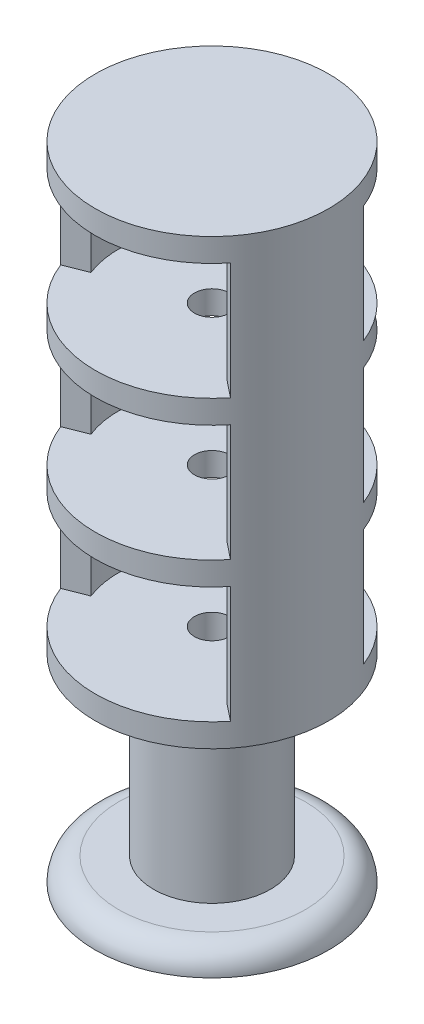
ISO-10303-21;
HEADER;
FILE_DESCRIPTION(('STEP AP214'),'2;1');
FILE_NAME('part.step','',(''),(''),'','','');
FILE_SCHEMA(('AUTOMOTIVE_DESIGN { 1 0 10303 214 1 1 1 1 }'));
ENDSEC;
DATA;
#1=APPLICATION_CONTEXT('core data for automotive mechanical design processes');
#2=APPLICATION_PROTOCOL_DEFINITION('international standard','automotive_design',2000,#1);
#3=PRODUCT_CONTEXT('',#1,'mechanical');
#4=PRODUCT('Part','Part','',(#3));
#5=PRODUCT_RELATED_PRODUCT_CATEGORY('part','',(#4));
#6=PRODUCT_DEFINITION_FORMATION('','',#4);
#7=PRODUCT_DEFINITION_CONTEXT('part definition',#1,'design');
#8=PRODUCT_DEFINITION('design','',#6,#7);
#9=PRODUCT_DEFINITION_SHAPE('','',#8);
#10=(LENGTH_UNIT() NAMED_UNIT(*) SI_UNIT(.MILLI.,.METRE.));
#11=(NAMED_UNIT(*) PLANE_ANGLE_UNIT() SI_UNIT($,.RADIAN.));
#12=(NAMED_UNIT(*) SI_UNIT($,.STERADIAN.) SOLID_ANGLE_UNIT());
#13=UNCERTAINTY_MEASURE_WITH_UNIT(LENGTH_MEASURE(1.E-05),#10,'distance_accuracy_value','');
#14=(GEOMETRIC_REPRESENTATION_CONTEXT(3) GLOBAL_UNCERTAINTY_ASSIGNED_CONTEXT((#13)) GLOBAL_UNIT_ASSIGNED_CONTEXT((#10,
#11,#12)) REPRESENTATION_CONTEXT('',''));
#15=CARTESIAN_POINT('',(0.,0.,0.));
#16=DIRECTION('',(0.,0.,1.));
#17=DIRECTION('',(1.,0.,0.));
#18=AXIS2_PLACEMENT_3D('',#15,#16,#17);
#19=CARTESIAN_POINT('',(0.,0.,0.));
#20=DIRECTION('',(0.,1.,0.));
#21=DIRECTION('',(0.,0.,1.));
#22=AXIS2_PLACEMENT_3D('',#19,#20,#21);
#23=PLANE('',#22);
#24=CARTESIAN_POINT('',(0.,0.,0.));
#25=DIRECTION('',(0.,1.,0.));
#26=DIRECTION('',(0.,0.,1.));
#27=AXIS2_PLACEMENT_3D('',#24,#25,#26);
#28=CIRCLE('',#27,8.);
#29=CARTESIAN_POINT('',(0.,0.,8.));
#30=VERTEX_POINT('',#29);
#31=EDGE_CURVE('E13',#30,#30,#28,.T.);
#32=ORIENTED_EDGE('',*,*,#31,.T.);
#33=EDGE_LOOP('',(#32));
#34=FACE_BOUND('',#33,.T.);
#35=CARTESIAN_POINT('',(0.,0.,0.));
#36=DIRECTION('',(0.,1.,0.));
#37=DIRECTION('',(0.,0.,1.));
#38=AXIS2_PLACEMENT_3D('',#35,#36,#37);
#39=CIRCLE('',#38,5.);
#40=CARTESIAN_POINT('',(0.,0.,5.));
#41=VERTEX_POINT('',#40);
#42=EDGE_CURVE('E482',#41,#41,#39,.T.);
#43=ORIENTED_EDGE('',*,*,#42,.F.);
#44=EDGE_LOOP('',(#43));
#45=FACE_BOUND('',#44,.T.);
#46=ADVANCED_FACE('F50',(#34,#45),#23,.T.);
#47=CARTESIAN_POINT('',(0.,-2.,0.));
#48=DIRECTION('',(0.,1.,0.));
#49=DIRECTION('',(0.,0.,1.));
#50=AXIS2_PLACEMENT_3D('',#47,#48,#49);
#51=PLANE('',#50);
#52=CARTESIAN_POINT('',(0.,-2.,0.));
#53=DIRECTION('',(0.,-1.,0.));
#54=DIRECTION('',(0.,0.,-1.));
#55=AXIS2_PLACEMENT_3D('',#52,#53,#54);
#56=CIRCLE('',#55,2.5);
#57=CARTESIAN_POINT('',(0.,-2.,-2.5));
#58=VERTEX_POINT('',#57);
#59=EDGE_CURVE('E509',#58,#58,#56,.T.);
#60=ORIENTED_EDGE('',*,*,#59,.F.);
#61=EDGE_LOOP('',(#60));
#62=FACE_BOUND('',#61,.T.);
#63=CARTESIAN_POINT('',(0.,-2.,0.));
#64=DIRECTION('',(0.,1.,0.));
#65=DIRECTION('',(0.,0.,1.));
#66=AXIS2_PLACEMENT_3D('',#63,#64,#65);
#67=CIRCLE('',#66,10.);
#68=CARTESIAN_POINT('',(0.,-2.,10.));
#69=VERTEX_POINT('',#68);
#70=EDGE_CURVE('E59',#69,#69,#67,.T.);
#71=ORIENTED_EDGE('',*,*,#70,.F.);
#72=EDGE_LOOP('',(#71));
#73=FACE_BOUND('',#72,.T.);
#74=ADVANCED_FACE('F608',(#62,#73),#51,.F.);
#75=CARTESIAN_POINT('',(0.,-16.142135623731,0.));
#76=DIRECTION('',(0.,1.,0.));
#77=DIRECTION('',(0.,0.,1.));
#78=AXIS2_PLACEMENT_3D('',#75,#76,#77);
#79=CYLINDRICAL_SURFACE('',#78,1.5);
#80=CARTESIAN_POINT('',(0.,13.,0.));
#81=DIRECTION('',(0.,1.,0.));
#82=DIRECTION('',(0.,0.,1.));
#83=AXIS2_PLACEMENT_3D('',#80,#81,#82);
#84=CIRCLE('',#83,1.5);
#85=CARTESIAN_POINT('',(0.,13.,1.5));
#86=VERTEX_POINT('',#85);
#87=EDGE_CURVE('E496',#86,#86,#84,.F.);
#88=ORIENTED_EDGE('',*,*,#87,.T.);
#89=EDGE_LOOP('',(#88));
#90=FACE_BOUND('',#89,.T.);
#91=CARTESIAN_POINT('',(0.,17.,0.));
#92=DIRECTION('',(0.,1.,0.));
#93=DIRECTION('',(0.,0.,1.));
#94=AXIS2_PLACEMENT_3D('',#91,#92,#93);
#95=CIRCLE('',#94,1.5);
#96=CARTESIAN_POINT('',(0.,17.,1.5));
#97=VERTEX_POINT('',#96);
#98=EDGE_CURVE('E251',#97,#97,#95,.T.);
#99=ORIENTED_EDGE('',*,*,#98,.T.);
#100=EDGE_LOOP('',(#99));
#101=FACE_BOUND('',#100,.T.);
#102=ADVANCED_FACE('F531',(#90,#101),#79,.F.);
#103=CARTESIAN_POINT('',(0.,17.,0.));
#104=DIRECTION('',(0.,1.,0.));
#105=DIRECTION('',(0.,0.,1.));
#106=AXIS2_PLACEMENT_3D('',#103,#104,#105);
#107=PLANE('',#106);
#108=ORIENTED_EDGE('',*,*,#98,.F.);
#109=EDGE_LOOP('',(#108));
#110=FACE_BOUND('',#109,.T.);
#111=CARTESIAN_POINT('',(0.,17.,0.));
#112=DIRECTION('',(0.,1.,0.));
#113=DIRECTION('',(0.,0.,1.));
#114=AXIS2_PLACEMENT_3D('',#111,#112,#113);
#115=CIRCLE('',#114,10.);
#116=CARTESIAN_POINT('',(-9.30914679157328,17.,3.65236717937024));
#117=VERTEX_POINT('',#116);
#118=CARTESIAN_POINT('',(7.81761615706981,17.,6.2357740193757));
#119=VERTEX_POINT('',#118);
#120=EDGE_CURVE('E479',#117,#119,#115,.T.);
#121=ORIENTED_EDGE('',*,*,#120,.T.);
#122=DIRECTION('',(0.781761615706981,0.,0.62357740193757));
#123=VECTOR('',#122,1.);
#124=CARTESIAN_POINT('',(0.,17.,0.));
#125=LINE('',#124,#123);
#126=CARTESIAN_POINT('',(6.25409292565585,17.,4.98861921550056));
#127=VERTEX_POINT('',#126);
#128=EDGE_CURVE('E419',#127,#119,#125,.T.);
#129=ORIENTED_EDGE('',*,*,#128,.F.);
#130=CARTESIAN_POINT('',(0.,17.,0.));
#131=DIRECTION('',(0.,1.,0.));
#132=DIRECTION('',(0.,0.,1.));
#133=AXIS2_PLACEMENT_3D('',#130,#131,#132);
#134=CIRCLE('',#133,8.);
#135=CARTESIAN_POINT('',(7.44731743325862,17.,-2.92189374349619));
#136=VERTEX_POINT('',#135);
#137=EDGE_CURVE('E397',#127,#136,#134,.T.);
#138=ORIENTED_EDGE('',*,*,#137,.T.);
#139=DIRECTION('',(-0.930914679157328,0.,0.365236717937024));
#140=VECTOR('',#139,1.);
#141=CARTESIAN_POINT('',(0.,17.,0.));
#142=LINE('',#141,#140);
#143=CARTESIAN_POINT('',(9.30914679157328,17.,-3.65236717937024));
#144=VERTEX_POINT('',#143);
#145=EDGE_CURVE('E408',#144,#136,#142,.T.);
#146=ORIENTED_EDGE('',*,*,#145,.F.);
#147=CARTESIAN_POINT('',(-7.81761615706982,17.,-6.2357740193757));
#148=VERTEX_POINT('',#147);
#149=EDGE_CURVE('E483',#144,#148,#115,.T.);
#150=ORIENTED_EDGE('',*,*,#149,.T.);
#151=DIRECTION('',(0.781761615706981,0.,0.62357740193757));
#152=VECTOR('',#151,1.);
#153=CARTESIAN_POINT('',(0.,17.,0.));
#154=LINE('',#153,#152);
#155=CARTESIAN_POINT('',(-6.25409292565585,17.,-4.98861921550056));
#156=VERTEX_POINT('',#155);
#157=EDGE_CURVE('E458',#148,#156,#154,.T.);
#158=ORIENTED_EDGE('',*,*,#157,.T.);
#159=CARTESIAN_POINT('',(0.,17.,0.));
#160=DIRECTION('',(0.,1.,0.));
#161=DIRECTION('',(0.,0.,1.));
#162=AXIS2_PLACEMENT_3D('',#159,#160,#161);
#163=CIRCLE('',#162,8.);
#164=CARTESIAN_POINT('',(-7.44731743325862,17.,2.92189374349619));
#165=VERTEX_POINT('',#164);
#166=EDGE_CURVE('E441',#156,#165,#163,.T.);
#167=ORIENTED_EDGE('',*,*,#166,.T.);
#168=DIRECTION('',(-0.930914679157328,0.,0.365236717937024));
#169=VECTOR('',#168,1.);
#170=CARTESIAN_POINT('',(0.,17.,0.));
#171=LINE('',#170,#169);
#172=EDGE_CURVE('E447',#165,#117,#171,.T.);
#173=ORIENTED_EDGE('',*,*,#172,.T.);
#174=EDGE_LOOP('',(#121,#129,#138,#146,#150,#158,#167,#173));
#175=FACE_BOUND('',#174,.T.);
#176=ADVANCED_FACE('F533',(#110,#175),#107,.T.);
#177=CARTESIAN_POINT('',(0.,15.,0.));
#178=DIRECTION('',(0.,-1.,0.));
#179=DIRECTION('',(0.,0.,-1.));
#180=AXIS2_PLACEMENT_3D('',#177,#178,#179);
#181=CYLINDRICAL_SURFACE('',#180,5.);
#182=CARTESIAN_POINT('',(0.,15.,0.));
#183=DIRECTION('',(0.,1.,0.));
#184=DIRECTION('',(0.,0.,1.));
#185=AXIS2_PLACEMENT_3D('',#182,#183,#184);
#186=CIRCLE('',#185,5.);
#187=CARTESIAN_POINT('',(0.,15.,5.));
#188=VERTEX_POINT('',#187);
#189=EDGE_CURVE('E487',#188,#188,#186,.T.);
#190=ORIENTED_EDGE('',*,*,#189,.F.);
#191=EDGE_LOOP('',(#190));
#192=FACE_BOUND('',#191,.T.);
#193=ORIENTED_EDGE('',*,*,#42,.T.);
#194=EDGE_LOOP('',(#193));
#195=FACE_BOUND('',#194,.T.);
#196=ADVANCED_FACE('F536',(#192,#195),#181,.T.);
#197=CARTESIAN_POINT('',(0.,17.,0.));
#198=DIRECTION('',(0.,-1.,0.));
#199=DIRECTION('',(0.,0.,-1.));
#200=AXIS2_PLACEMENT_3D('',#197,#198,#199);
#201=CYLINDRICAL_SURFACE('',#200,10.);
#202=DIRECTION('',(0.,-1.,0.));
#203=VECTOR('',#202,1.);
#204=CARTESIAN_POINT('',(-9.30914679157328,51.,3.65236717937024));
#205=LINE('',#204,#203);
#206=CARTESIAN_POINT('',(-9.30914679157328,51.,3.65236717937024));
#207=VERTEX_POINT('',#206);
#208=CARTESIAN_POINT('',(-9.30914679157328,41.,3.65236717937024));
#209=VERTEX_POINT('',#208);
#210=EDGE_CURVE('E303',#207,#209,#205,.T.);
#211=ORIENTED_EDGE('',*,*,#210,.F.);
#212=CARTESIAN_POINT('',(0.,51.,0.));
#213=DIRECTION('',(0.,1.,0.));
#214=DIRECTION('',(0.,0.,1.));
#215=AXIS2_PLACEMENT_3D('',#212,#213,#214);
#216=CIRCLE('',#215,10.);
#217=CARTESIAN_POINT('',(7.81761615706982,51.,6.2357740193757));
#218=VERTEX_POINT('',#217);
#219=EDGE_CURVE('E243',#207,#218,#216,.T.);
#220=ORIENTED_EDGE('',*,*,#219,.T.);
#221=DIRECTION('',(0.,-1.,0.));
#222=VECTOR('',#221,1.);
#223=CARTESIAN_POINT('',(7.81761615706982,51.,6.2357740193757));
#224=LINE('',#223,#222);
#225=CARTESIAN_POINT('',(7.81761615706981,41.,6.2357740193757));
#226=VERTEX_POINT('',#225);
#227=EDGE_CURVE('E233',#218,#226,#224,.T.);
#228=ORIENTED_EDGE('',*,*,#227,.T.);
#229=CARTESIAN_POINT('',(0.,41.,0.));
#230=DIRECTION('',(0.,1.,0.));
#231=DIRECTION('',(0.,0.,1.));
#232=AXIS2_PLACEMENT_3D('',#229,#230,#231);
#233=CIRCLE('',#232,10.);
#234=EDGE_CURVE('E310',#209,#226,#233,.T.);
#235=ORIENTED_EDGE('',*,*,#234,.F.);
#236=EDGE_LOOP('',(#211,#220,#228,#235));
#237=FACE_BOUND('',#236,.T.);
#238=DIRECTION('',(0.,-1.,0.));
#239=VECTOR('',#238,1.);
#240=CARTESIAN_POINT('',(-9.30914679157328,39.,3.65236717937024));
#241=LINE('',#240,#239);
#242=CARTESIAN_POINT('',(-9.30914679157328,39.,3.65236717937024));
#243=VERTEX_POINT('',#242);
#244=CARTESIAN_POINT('',(-9.30914679157328,29.,3.65236717937024));
#245=VERTEX_POINT('',#244);
#246=EDGE_CURVE('E387',#243,#245,#241,.T.);
#247=ORIENTED_EDGE('',*,*,#246,.F.);
#248=CARTESIAN_POINT('',(0.,39.,0.));
#249=DIRECTION('',(0.,1.,0.));
#250=DIRECTION('',(0.,0.,1.));
#251=AXIS2_PLACEMENT_3D('',#248,#249,#250);
#252=CIRCLE('',#251,10.);
#253=CARTESIAN_POINT('',(7.81761615706982,39.,6.23577401937571));
#254=VERTEX_POINT('',#253);
#255=EDGE_CURVE('E299',#243,#254,#252,.T.);
#256=ORIENTED_EDGE('',*,*,#255,.T.);
#257=DIRECTION('',(0.,-1.,0.));
#258=VECTOR('',#257,1.);
#259=CARTESIAN_POINT('',(7.81761615706982,39.,6.23577401937571));
#260=LINE('',#259,#258);
#261=CARTESIAN_POINT('',(7.81761615706981,29.,6.2357740193757));
#262=VERTEX_POINT('',#261);
#263=EDGE_CURVE('E348',#254,#262,#260,.T.);
#264=ORIENTED_EDGE('',*,*,#263,.T.);
#265=CARTESIAN_POINT('',(0.,29.,0.));
#266=DIRECTION('',(0.,1.,0.));
#267=DIRECTION('',(0.,0.,1.));
#268=AXIS2_PLACEMENT_3D('',#265,#266,#267);
#269=CIRCLE('',#268,10.);
#270=EDGE_CURVE('E394',#245,#262,#269,.T.);
#271=ORIENTED_EDGE('',*,*,#270,.F.);
#272=EDGE_LOOP('',(#247,#256,#264,#271));
#273=FACE_BOUND('',#272,.T.);
#274=DIRECTION('',(0.,-1.,0.));
#275=VECTOR('',#274,1.);
#276=CARTESIAN_POINT('',(-9.30914679157328,27.,3.65236717937024));
#277=LINE('',#276,#275);
#278=CARTESIAN_POINT('',(-9.30914679157328,27.,3.65236717937024));
#279=VERTEX_POINT('',#278);
#280=EDGE_CURVE('E467',#279,#117,#277,.T.);
#281=ORIENTED_EDGE('',*,*,#280,.F.);
#282=CARTESIAN_POINT('',(0.,27.,0.));
#283=DIRECTION('',(0.,1.,0.));
#284=DIRECTION('',(0.,0.,1.));
#285=AXIS2_PLACEMENT_3D('',#282,#283,#284);
#286=CIRCLE('',#285,10.);
#287=CARTESIAN_POINT('',(7.81761615706982,27.,6.2357740193757));
#288=VERTEX_POINT('',#287);
#289=EDGE_CURVE('E382',#279,#288,#286,.T.);
#290=ORIENTED_EDGE('',*,*,#289,.T.);
#291=DIRECTION('',(0.,-1.,0.));
#292=VECTOR('',#291,1.);
#293=CARTESIAN_POINT('',(7.81761615706982,27.,6.2357740193757));
#294=LINE('',#293,#292);
#295=EDGE_CURVE('E433',#288,#119,#294,.T.);
#296=ORIENTED_EDGE('',*,*,#295,.T.);
#297=ORIENTED_EDGE('',*,*,#120,.F.);
#298=EDGE_LOOP('',(#281,#290,#296,#297));
#299=FACE_BOUND('',#298,.T.);
#300=CARTESIAN_POINT('',(9.30914679157328,27.,-3.65236717937024));
#301=VERTEX_POINT('',#300);
#302=CARTESIAN_POINT('',(-7.81761615706982,27.,-6.2357740193757));
#303=VERTEX_POINT('',#302);
#304=EDGE_CURVE('E402',#301,#303,#286,.T.);
#305=ORIENTED_EDGE('',*,*,#304,.T.);
#306=DIRECTION('',(0.,-1.,0.));
#307=VECTOR('',#306,1.);
#308=CARTESIAN_POINT('',(-7.81761615706982,27.,-6.2357740193757));
#309=LINE('',#308,#307);
#310=EDGE_CURVE('E470',#303,#148,#309,.T.);
#311=ORIENTED_EDGE('',*,*,#310,.T.);
#312=ORIENTED_EDGE('',*,*,#149,.F.);
#313=DIRECTION('',(0.,-1.,0.));
#314=VECTOR('',#313,1.);
#315=CARTESIAN_POINT('',(9.30914679157328,27.,-3.65236717937024));
#316=LINE('',#315,#314);
#317=EDGE_CURVE('E429',#301,#144,#316,.T.);
#318=ORIENTED_EDGE('',*,*,#317,.F.);
#319=EDGE_LOOP('',(#305,#311,#312,#318));
#320=FACE_BOUND('',#319,.T.);
#321=CARTESIAN_POINT('',(0.,15.,0.));
#322=DIRECTION('',(0.,1.,0.));
#323=DIRECTION('',(0.,0.,1.));
#324=AXIS2_PLACEMENT_3D('',#321,#322,#323);
#325=CIRCLE('',#324,10.);
#326=CARTESIAN_POINT('',(0.,15.,10.));
#327=VERTEX_POINT('',#326);
#328=EDGE_CURVE('E478',#327,#327,#325,.T.);
#329=ORIENTED_EDGE('',*,*,#328,.T.);
#330=EDGE_LOOP('',(#329));
#331=FACE_BOUND('',#330,.T.);
#332=CARTESIAN_POINT('',(9.30914679157328,39.,-3.65236717937024));
#333=VERTEX_POINT('',#332);
#334=CARTESIAN_POINT('',(-7.81761615706981,39.,-6.23577401937571));
#335=VERTEX_POINT('',#334);
#336=EDGE_CURVE('E317',#333,#335,#252,.T.);
#337=ORIENTED_EDGE('',*,*,#336,.T.);
#338=DIRECTION('',(0.,-1.,0.));
#339=VECTOR('',#338,1.);
#340=CARTESIAN_POINT('',(-7.81761615706981,39.,-6.23577401937571));
#341=LINE('',#340,#339);
#342=CARTESIAN_POINT('',(-7.81761615706981,29.,-6.23577401937571));
#343=VERTEX_POINT('',#342);
#344=EDGE_CURVE('E383',#335,#343,#341,.T.);
#345=ORIENTED_EDGE('',*,*,#344,.T.);
#346=CARTESIAN_POINT('',(9.30914679157328,29.,-3.65236717937024));
#347=VERTEX_POINT('',#346);
#348=EDGE_CURVE('E398',#347,#343,#269,.T.);
#349=ORIENTED_EDGE('',*,*,#348,.F.);
#350=DIRECTION('',(0.,-1.,0.));
#351=VECTOR('',#350,1.);
#352=CARTESIAN_POINT('',(9.30914679157328,39.,-3.65236717937024));
#353=LINE('',#352,#351);
#354=EDGE_CURVE('E330',#333,#347,#353,.T.);
#355=ORIENTED_EDGE('',*,*,#354,.F.);
#356=EDGE_LOOP('',(#337,#345,#349,#355));
#357=FACE_BOUND('',#356,.T.);
#358=CARTESIAN_POINT('',(9.30914679157328,51.,-3.65236717937024));
#359=VERTEX_POINT('',#358);
#360=CARTESIAN_POINT('',(-7.81761615706981,51.,-6.23577401937571));
#361=VERTEX_POINT('',#360);
#362=EDGE_CURVE('E230',#359,#361,#216,.T.);
#363=ORIENTED_EDGE('',*,*,#362,.T.);
#364=DIRECTION('',(0.,-1.,0.));
#365=VECTOR('',#364,1.);
#366=CARTESIAN_POINT('',(-7.81761615706981,51.,-6.23577401937571));
#367=LINE('',#366,#365);
#368=CARTESIAN_POINT('',(-7.81761615706981,41.,-6.23577401937571));
#369=VERTEX_POINT('',#368);
#370=EDGE_CURVE('E300',#361,#369,#367,.T.);
#371=ORIENTED_EDGE('',*,*,#370,.T.);
#372=CARTESIAN_POINT('',(9.30914679157328,41.,-3.65236717937024));
#373=VERTEX_POINT('',#372);
#374=EDGE_CURVE('E231',#373,#369,#233,.T.);
#375=ORIENTED_EDGE('',*,*,#374,.F.);
#376=DIRECTION('',(0.,-1.,0.));
#377=VECTOR('',#376,1.);
#378=CARTESIAN_POINT('',(9.30914679157328,51.,-3.65236717937024));
#379=LINE('',#378,#377);
#380=EDGE_CURVE('E216',#359,#373,#379,.T.);
#381=ORIENTED_EDGE('',*,*,#380,.F.);
#382=EDGE_LOOP('',(#363,#371,#375,#381));
#383=FACE_BOUND('',#382,.T.);
#384=CARTESIAN_POINT('',(0.,53.,0.));
#385=DIRECTION('',(0.,1.,0.));
#386=DIRECTION('',(0.,0.,1.));
#387=AXIS2_PLACEMENT_3D('',#384,#385,#386);
#388=CIRCLE('',#387,10.);
#389=CARTESIAN_POINT('',(0.,53.,10.));
#390=VERTEX_POINT('',#389);
#391=EDGE_CURVE('E242',#390,#390,#388,.T.);
#392=ORIENTED_EDGE('',*,*,#391,.F.);
#393=EDGE_LOOP('',(#392));
#394=FACE_BOUND('',#393,.T.);
#395=ADVANCED_FACE('F227',(#237,#273,#299,#320,#331,#357,#383,#394),#201,.T.);
#396=CARTESIAN_POINT('',(0.,15.,0.));
#397=DIRECTION('',(0.,1.,0.));
#398=DIRECTION('',(0.,0.,1.));
#399=AXIS2_PLACEMENT_3D('',#396,#397,#398);
#400=PLANE('',#399);
#401=ORIENTED_EDGE('',*,*,#189,.T.);
#402=EDGE_LOOP('',(#401));
#403=FACE_BOUND('',#402,.T.);
#404=ORIENTED_EDGE('',*,*,#328,.F.);
#405=EDGE_LOOP('',(#404));
#406=FACE_BOUND('',#405,.T.);
#407=ADVANCED_FACE('F624',(#403,#406),#400,.F.);
#408=CARTESIAN_POINT('',(0.,27.,0.));
#409=DIRECTION('',(0.,-1.,0.));
#410=DIRECTION('',(0.,0.,-1.));
#411=AXIS2_PLACEMENT_3D('',#408,#409,#410);
#412=CYLINDRICAL_SURFACE('',#411,8.);
#413=ORIENTED_EDGE('',*,*,#166,.F.);
#414=DIRECTION('',(0.,-1.,0.));
#415=VECTOR('',#414,1.);
#416=CARTESIAN_POINT('',(-6.25409292565585,27.,-4.98861921550056));
#417=LINE('',#416,#415);
#418=CARTESIAN_POINT('',(-6.25409292565585,27.,-4.98861921550056));
#419=VERTEX_POINT('',#418);
#420=EDGE_CURVE('E474',#419,#156,#417,.T.);
#421=ORIENTED_EDGE('',*,*,#420,.F.);
#422=CARTESIAN_POINT('',(0.,27.,0.));
#423=DIRECTION('',(0.,1.,0.));
#424=DIRECTION('',(0.,0.,1.));
#425=AXIS2_PLACEMENT_3D('',#422,#423,#424);
#426=CIRCLE('',#425,8.);
#427=CARTESIAN_POINT('',(-7.44731743325862,27.,2.92189374349619));
#428=VERTEX_POINT('',#427);
#429=EDGE_CURVE('E442',#419,#428,#426,.T.);
#430=ORIENTED_EDGE('',*,*,#429,.T.);
#431=DIRECTION('',(0.,-1.,0.));
#432=VECTOR('',#431,1.);
#433=CARTESIAN_POINT('',(-7.44731743325862,27.,2.92189374349619));
#434=LINE('',#433,#432);
#435=EDGE_CURVE('E454',#428,#165,#434,.T.);
#436=ORIENTED_EDGE('',*,*,#435,.T.);
#437=EDGE_LOOP('',(#413,#421,#430,#436));
#438=FACE_BOUND('',#437,.T.);
#439=ADVANCED_FACE('F626',(#438),#412,.F.);
#440=CARTESIAN_POINT('',(0.,27.,0.));
#441=DIRECTION('',(0.62357740193757,0.,-0.781761615706981));
#442=DIRECTION('',(-0.781761615706981,0.,-0.62357740193757));
#443=AXIS2_PLACEMENT_3D('',#440,#441,#442);
#444=PLANE('',#443);
#445=ORIENTED_EDGE('',*,*,#157,.F.);
#446=ORIENTED_EDGE('',*,*,#310,.F.);
#447=DIRECTION('',(0.781761615706981,0.,0.62357740193757));
#448=VECTOR('',#447,1.);
#449=CARTESIAN_POINT('',(0.,27.,0.));
#450=LINE('',#449,#448);
#451=EDGE_CURVE('E446',#303,#419,#450,.T.);
#452=ORIENTED_EDGE('',*,*,#451,.T.);
#453=ORIENTED_EDGE('',*,*,#420,.T.);
#454=EDGE_LOOP('',(#445,#446,#452,#453));
#455=FACE_BOUND('',#454,.T.);
#456=ADVANCED_FACE('F631',(#455),#444,.T.);
#457=CARTESIAN_POINT('',(0.,27.,0.));
#458=DIRECTION('',(0.365236717937024,0.,0.930914679157328));
#459=DIRECTION('',(0.930914679157328,0.,-0.365236717937024));
#460=AXIS2_PLACEMENT_3D('',#457,#458,#459);
#461=PLANE('',#460);
#462=ORIENTED_EDGE('',*,*,#172,.F.);
#463=ORIENTED_EDGE('',*,*,#435,.F.);
#464=DIRECTION('',(-0.930914679157328,0.,0.365236717937024));
#465=VECTOR('',#464,1.);
#466=CARTESIAN_POINT('',(0.,27.,0.));
#467=LINE('',#466,#465);
#468=EDGE_CURVE('E451',#428,#279,#467,.T.);
#469=ORIENTED_EDGE('',*,*,#468,.T.);
#470=ORIENTED_EDGE('',*,*,#280,.T.);
#471=EDGE_LOOP('',(#462,#463,#469,#470));
#472=FACE_BOUND('',#471,.T.);
#473=ADVANCED_FACE('F635',(#472),#461,.T.);
#474=CARTESIAN_POINT('',(0.,27.,0.));
#475=DIRECTION('',(0.,-1.,0.));
#476=DIRECTION('',(0.,0.,-1.));
#477=AXIS2_PLACEMENT_3D('',#474,#475,#476);
#478=CYLINDRICAL_SURFACE('',#477,8.);
#479=ORIENTED_EDGE('',*,*,#137,.F.);
#480=DIRECTION('',(0.,-1.,0.));
#481=VECTOR('',#480,1.);
#482=CARTESIAN_POINT('',(6.25409292565585,27.,4.98861921550056));
#483=LINE('',#482,#481);
#484=CARTESIAN_POINT('',(6.25409292565585,27.,4.98861921550056));
#485=VERTEX_POINT('',#484);
#486=EDGE_CURVE('E437',#485,#127,#483,.T.);
#487=ORIENTED_EDGE('',*,*,#486,.F.);
#488=CARTESIAN_POINT('',(0.,27.,0.));
#489=DIRECTION('',(0.,1.,0.));
#490=DIRECTION('',(0.,0.,1.));
#491=AXIS2_PLACEMENT_3D('',#488,#489,#490);
#492=CIRCLE('',#491,8.);
#493=CARTESIAN_POINT('',(7.44731743325862,27.,-2.92189374349619));
#494=VERTEX_POINT('',#493);
#495=EDGE_CURVE('E403',#485,#494,#492,.T.);
#496=ORIENTED_EDGE('',*,*,#495,.T.);
#497=DIRECTION('',(0.,-1.,0.));
#498=VECTOR('',#497,1.);
#499=CARTESIAN_POINT('',(7.44731743325862,27.,-2.92189374349619));
#500=LINE('',#499,#498);
#501=EDGE_CURVE('E416',#494,#136,#500,.T.);
#502=ORIENTED_EDGE('',*,*,#501,.T.);
#503=EDGE_LOOP('',(#479,#487,#496,#502));
#504=FACE_BOUND('',#503,.T.);
#505=ADVANCED_FACE('F556',(#504),#478,.F.);
#506=CARTESIAN_POINT('',(0.,27.,0.));
#507=DIRECTION('',(0.62357740193757,0.,-0.781761615706981));
#508=DIRECTION('',(-0.781761615706981,0.,-0.62357740193757));
#509=AXIS2_PLACEMENT_3D('',#506,#507,#508);
#510=PLANE('',#509);
#511=ORIENTED_EDGE('',*,*,#128,.T.);
#512=ORIENTED_EDGE('',*,*,#295,.F.);
#513=DIRECTION('',(0.781761615706981,0.,0.62357740193757));
#514=VECTOR('',#513,1.);
#515=CARTESIAN_POINT('',(0.,27.,0.));
#516=LINE('',#515,#514);
#517=EDGE_CURVE('E407',#485,#288,#516,.T.);
#518=ORIENTED_EDGE('',*,*,#517,.F.);
#519=ORIENTED_EDGE('',*,*,#486,.T.);
#520=EDGE_LOOP('',(#511,#512,#518,#519));
#521=FACE_BOUND('',#520,.T.);
#522=ADVANCED_FACE('F543',(#521),#510,.F.);
#523=CARTESIAN_POINT('',(0.,27.,0.));
#524=DIRECTION('',(0.365236717937024,0.,0.930914679157328));
#525=DIRECTION('',(0.930914679157328,0.,-0.365236717937024));
#526=AXIS2_PLACEMENT_3D('',#523,#524,#525);
#527=PLANE('',#526);
#528=ORIENTED_EDGE('',*,*,#145,.T.);
#529=ORIENTED_EDGE('',*,*,#501,.F.);
#530=DIRECTION('',(-0.930914679157328,0.,0.365236717937024));
#531=VECTOR('',#530,1.);
#532=CARTESIAN_POINT('',(0.,27.,0.));
#533=LINE('',#532,#531);
#534=EDGE_CURVE('E412',#301,#494,#533,.T.);
#535=ORIENTED_EDGE('',*,*,#534,.F.);
#536=ORIENTED_EDGE('',*,*,#317,.T.);
#537=EDGE_LOOP('',(#528,#529,#535,#536));
#538=FACE_BOUND('',#537,.T.);
#539=ADVANCED_FACE('F560',(#538),#527,.F.);
#540=CARTESIAN_POINT('',(0.,27.,0.));
#541=DIRECTION('',(0.,1.,0.));
#542=DIRECTION('',(0.,0.,1.));
#543=AXIS2_PLACEMENT_3D('',#540,#541,#542);
#544=PLANE('',#543);
#545=CARTESIAN_POINT('',(0.,27.,0.));
#546=DIRECTION('',(0.,1.,0.));
#547=DIRECTION('',(0.,0.,1.));
#548=AXIS2_PLACEMENT_3D('',#545,#546,#547);
#549=CIRCLE('',#548,1.5);
#550=CARTESIAN_POINT('',(0.,27.,1.5));
#551=VERTEX_POINT('',#550);
#552=EDGE_CURVE('E524',#551,#551,#549,.T.);
#553=ORIENTED_EDGE('',*,*,#552,.T.);
#554=EDGE_LOOP('',(#553));
#555=FACE_BOUND('',#554,.T.);
#556=ORIENTED_EDGE('',*,*,#451,.F.);
#557=ORIENTED_EDGE('',*,*,#304,.F.);
#558=ORIENTED_EDGE('',*,*,#534,.T.);
#559=ORIENTED_EDGE('',*,*,#495,.F.);
#560=ORIENTED_EDGE('',*,*,#517,.T.);
#561=ORIENTED_EDGE('',*,*,#289,.F.);
#562=ORIENTED_EDGE('',*,*,#468,.F.);
#563=ORIENTED_EDGE('',*,*,#429,.F.);
#564=EDGE_LOOP('',(#556,#557,#558,#559,#560,#561,#562,#563));
#565=FACE_BOUND('',#564,.T.);
#566=ADVANCED_FACE('F551',(#555,#565),#544,.F.);
#567=CARTESIAN_POINT('',(0.,29.,0.));
#568=DIRECTION('',(0.,1.,0.));
#569=DIRECTION('',(0.,0.,1.));
#570=AXIS2_PLACEMENT_3D('',#567,#568,#569);
#571=PLANE('',#570);
#572=CARTESIAN_POINT('',(0.,29.,0.));
#573=DIRECTION('',(0.,1.,0.));
#574=DIRECTION('',(0.,0.,1.));
#575=AXIS2_PLACEMENT_3D('',#572,#573,#574);
#576=CIRCLE('',#575,1.5);
#577=CARTESIAN_POINT('',(0.,29.,1.5));
#578=VERTEX_POINT('',#577);
#579=EDGE_CURVE('E520',#578,#578,#576,.T.);
#580=ORIENTED_EDGE('',*,*,#579,.F.);
#581=EDGE_LOOP('',(#580));
#582=FACE_BOUND('',#581,.T.);
#583=DIRECTION('',(0.930914679157328,0.,-0.365236717937024));
#584=VECTOR('',#583,1.);
#585=CARTESIAN_POINT('',(0.,29.,0.));
#586=LINE('',#585,#584);
#587=CARTESIAN_POINT('',(7.44731743325862,29.,-2.92189374349619));
#588=VERTEX_POINT('',#587);
#589=EDGE_CURVE('E313',#588,#347,#586,.T.);
#590=ORIENTED_EDGE('',*,*,#589,.T.);
#591=ORIENTED_EDGE('',*,*,#348,.T.);
#592=DIRECTION('',(-0.781761615706981,0.,-0.62357740193757));
#593=VECTOR('',#592,1.);
#594=CARTESIAN_POINT('',(0.,29.,0.));
#595=LINE('',#594,#593);
#596=CARTESIAN_POINT('',(-6.25409292565585,29.,-4.98861921550056));
#597=VERTEX_POINT('',#596);
#598=EDGE_CURVE('E360',#597,#343,#595,.T.);
#599=ORIENTED_EDGE('',*,*,#598,.F.);
#600=CARTESIAN_POINT('',(0.,29.,0.));
#601=DIRECTION('',(0.,1.,0.));
#602=DIRECTION('',(0.,0.,1.));
#603=AXIS2_PLACEMENT_3D('',#600,#601,#602);
#604=CIRCLE('',#603,8.);
#605=CARTESIAN_POINT('',(-7.44731743325862,29.,2.92189374349619));
#606=VERTEX_POINT('',#605);
#607=EDGE_CURVE('E343',#597,#606,#604,.T.);
#608=ORIENTED_EDGE('',*,*,#607,.T.);
#609=DIRECTION('',(0.930914679157328,0.,-0.365236717937024));
#610=VECTOR('',#609,1.);
#611=CARTESIAN_POINT('',(0.,29.,0.));
#612=LINE('',#611,#610);
#613=EDGE_CURVE('E371',#245,#606,#612,.T.);
#614=ORIENTED_EDGE('',*,*,#613,.F.);
#615=ORIENTED_EDGE('',*,*,#270,.T.);
#616=DIRECTION('',(-0.781761615706981,0.,-0.62357740193757));
#617=VECTOR('',#616,1.);
#618=CARTESIAN_POINT('',(0.,29.,0.));
#619=LINE('',#618,#617);
#620=CARTESIAN_POINT('',(6.25409292565585,29.,4.98861921550056));
#621=VERTEX_POINT('',#620);
#622=EDGE_CURVE('E334',#262,#621,#619,.T.);
#623=ORIENTED_EDGE('',*,*,#622,.T.);
#624=CARTESIAN_POINT('',(0.,29.,0.));
#625=DIRECTION('',(0.,1.,0.));
#626=DIRECTION('',(0.,0.,1.));
#627=AXIS2_PLACEMENT_3D('',#624,#625,#626);
#628=CIRCLE('',#627,8.);
#629=EDGE_CURVE('E322',#621,#588,#628,.T.);
#630=ORIENTED_EDGE('',*,*,#629,.T.);
#631=EDGE_LOOP('',(#590,#591,#599,#608,#614,#615,#623,#630));
#632=FACE_BOUND('',#631,.T.);
#633=ADVANCED_FACE('F566',(#582,#632),#571,.T.);
#634=CARTESIAN_POINT('',(0.,39.,0.));
#635=DIRECTION('',(0.,-1.,0.));
#636=DIRECTION('',(0.,0.,-1.));
#637=AXIS2_PLACEMENT_3D('',#634,#635,#636);
#638=CYLINDRICAL_SURFACE('',#637,8.);
#639=ORIENTED_EDGE('',*,*,#607,.F.);
#640=DIRECTION('',(0.,-1.,0.));
#641=VECTOR('',#640,1.);
#642=CARTESIAN_POINT('',(-6.25409292565585,39.,-4.98861921550056));
#643=LINE('',#642,#641);
#644=CARTESIAN_POINT('',(-6.25409292565585,39.,-4.98861921550056));
#645=VERTEX_POINT('',#644);
#646=EDGE_CURVE('E378',#645,#597,#643,.T.);
#647=ORIENTED_EDGE('',*,*,#646,.F.);
#648=CARTESIAN_POINT('',(0.,39.,0.));
#649=DIRECTION('',(0.,1.,0.));
#650=DIRECTION('',(0.,0.,1.));
#651=AXIS2_PLACEMENT_3D('',#648,#649,#650);
#652=CIRCLE('',#651,8.);
#653=CARTESIAN_POINT('',(-7.44731743325862,39.,2.92189374349619));
#654=VERTEX_POINT('',#653);
#655=EDGE_CURVE('E355',#645,#654,#652,.T.);
#656=ORIENTED_EDGE('',*,*,#655,.T.);
#657=DIRECTION('',(0.,-1.,0.));
#658=VECTOR('',#657,1.);
#659=CARTESIAN_POINT('',(-7.44731743325862,39.,2.92189374349619));
#660=LINE('',#659,#658);
#661=EDGE_CURVE('E368',#654,#606,#660,.T.);
#662=ORIENTED_EDGE('',*,*,#661,.T.);
#663=EDGE_LOOP('',(#639,#647,#656,#662));
#664=FACE_BOUND('',#663,.T.);
#665=ADVANCED_FACE('F651',(#664),#638,.F.);
#666=CARTESIAN_POINT('',(0.,39.,0.));
#667=DIRECTION('',(-0.62357740193757,0.,0.781761615706981));
#668=DIRECTION('',(0.781761615706981,0.,0.62357740193757));
#669=AXIS2_PLACEMENT_3D('',#666,#667,#668);
#670=PLANE('',#669);
#671=ORIENTED_EDGE('',*,*,#598,.T.);
#672=ORIENTED_EDGE('',*,*,#344,.F.);
#673=DIRECTION('',(-0.781761615706981,0.,-0.62357740193757));
#674=VECTOR('',#673,1.);
#675=CARTESIAN_POINT('',(0.,39.,0.));
#676=LINE('',#675,#674);
#677=EDGE_CURVE('E364',#645,#335,#676,.T.);
#678=ORIENTED_EDGE('',*,*,#677,.F.);
#679=ORIENTED_EDGE('',*,*,#646,.T.);
#680=EDGE_LOOP('',(#671,#672,#678,#679));
#681=FACE_BOUND('',#680,.T.);
#682=ADVANCED_FACE('F571',(#681),#670,.F.);
#683=CARTESIAN_POINT('',(0.,39.,0.));
#684=DIRECTION('',(-0.365236717937024,0.,-0.930914679157328));
#685=DIRECTION('',(-0.930914679157328,0.,0.365236717937024));
#686=AXIS2_PLACEMENT_3D('',#683,#684,#685);
#687=PLANE('',#686);
#688=ORIENTED_EDGE('',*,*,#613,.T.);
#689=ORIENTED_EDGE('',*,*,#661,.F.);
#690=DIRECTION('',(0.930914679157328,0.,-0.365236717937024));
#691=VECTOR('',#690,1.);
#692=CARTESIAN_POINT('',(0.,39.,0.));
#693=LINE('',#692,#691);
#694=EDGE_CURVE('E359',#243,#654,#693,.T.);
#695=ORIENTED_EDGE('',*,*,#694,.F.);
#696=ORIENTED_EDGE('',*,*,#246,.T.);
#697=EDGE_LOOP('',(#688,#689,#695,#696));
#698=FACE_BOUND('',#697,.T.);
#699=ADVANCED_FACE('F656',(#698),#687,.F.);
#700=CARTESIAN_POINT('',(0.,39.,0.));
#701=DIRECTION('',(-0.365236717937024,0.,-0.930914679157328));
#702=DIRECTION('',(-0.930914679157328,0.,0.365236717937024));
#703=AXIS2_PLACEMENT_3D('',#700,#701,#702);
#704=PLANE('',#703);
#705=ORIENTED_EDGE('',*,*,#589,.F.);
#706=DIRECTION('',(0.,-1.,0.));
#707=VECTOR('',#706,1.);
#708=CARTESIAN_POINT('',(7.44731743325862,39.,-2.92189374349619));
#709=LINE('',#708,#707);
#710=CARTESIAN_POINT('',(7.44731743325862,39.,-2.92189374349619));
#711=VERTEX_POINT('',#710);
#712=EDGE_CURVE('E339',#711,#588,#709,.T.);
#713=ORIENTED_EDGE('',*,*,#712,.F.);
#714=DIRECTION('',(0.930914679157328,0.,-0.365236717937024));
#715=VECTOR('',#714,1.);
#716=CARTESIAN_POINT('',(0.,39.,0.));
#717=LINE('',#716,#715);
#718=EDGE_CURVE('E318',#711,#333,#717,.T.);
#719=ORIENTED_EDGE('',*,*,#718,.T.);
#720=ORIENTED_EDGE('',*,*,#354,.T.);
#721=EDGE_LOOP('',(#705,#713,#719,#720));
#722=FACE_BOUND('',#721,.T.);
#723=ADVANCED_FACE('F659',(#722),#704,.T.);
#724=CARTESIAN_POINT('',(0.,39.,0.));
#725=DIRECTION('',(0.,-1.,0.));
#726=DIRECTION('',(0.,0.,-1.));
#727=AXIS2_PLACEMENT_3D('',#724,#725,#726);
#728=CYLINDRICAL_SURFACE('',#727,8.);
#729=ORIENTED_EDGE('',*,*,#629,.F.);
#730=DIRECTION('',(0.,-1.,0.));
#731=VECTOR('',#730,1.);
#732=CARTESIAN_POINT('',(6.25409292565585,39.,4.98861921550056));
#733=LINE('',#732,#731);
#734=CARTESIAN_POINT('',(6.25409292565585,39.,4.98861921550056));
#735=VERTEX_POINT('',#734);
#736=EDGE_CURVE('E344',#735,#621,#733,.T.);
#737=ORIENTED_EDGE('',*,*,#736,.F.);
#738=CARTESIAN_POINT('',(0.,39.,0.));
#739=DIRECTION('',(0.,1.,0.));
#740=DIRECTION('',(0.,0.,1.));
#741=AXIS2_PLACEMENT_3D('',#738,#739,#740);
#742=CIRCLE('',#741,8.);
#743=EDGE_CURVE('E326',#735,#711,#742,.T.);
#744=ORIENTED_EDGE('',*,*,#743,.T.);
#745=ORIENTED_EDGE('',*,*,#712,.T.);
#746=EDGE_LOOP('',(#729,#737,#744,#745));
#747=FACE_BOUND('',#746,.T.);
#748=ADVANCED_FACE('F665',(#747),#728,.F.);
#749=CARTESIAN_POINT('',(0.,39.,0.));
#750=DIRECTION('',(-0.62357740193757,0.,0.781761615706981));
#751=DIRECTION('',(0.781761615706981,0.,0.62357740193757));
#752=AXIS2_PLACEMENT_3D('',#749,#750,#751);
#753=PLANE('',#752);
#754=ORIENTED_EDGE('',*,*,#622,.F.);
#755=ORIENTED_EDGE('',*,*,#263,.F.);
#756=DIRECTION('',(-0.781761615706981,0.,-0.62357740193757));
#757=VECTOR('',#756,1.);
#758=CARTESIAN_POINT('',(0.,39.,0.));
#759=LINE('',#758,#757);
#760=EDGE_CURVE('E321',#254,#735,#759,.T.);
#761=ORIENTED_EDGE('',*,*,#760,.T.);
#762=ORIENTED_EDGE('',*,*,#736,.T.);
#763=EDGE_LOOP('',(#754,#755,#761,#762));
#764=FACE_BOUND('',#763,.T.);
#765=ADVANCED_FACE('F667',(#764),#753,.T.);
#766=CARTESIAN_POINT('',(0.,39.,0.));
#767=DIRECTION('',(0.,1.,0.));
#768=DIRECTION('',(0.,0.,1.));
#769=AXIS2_PLACEMENT_3D('',#766,#767,#768);
#770=PLANE('',#769);
#771=CARTESIAN_POINT('',(0.,39.,0.));
#772=DIRECTION('',(0.,1.,0.));
#773=DIRECTION('',(0.,0.,1.));
#774=AXIS2_PLACEMENT_3D('',#771,#772,#773);
#775=CIRCLE('',#774,1.5);
#776=CARTESIAN_POINT('',(0.,39.,1.5));
#777=VERTEX_POINT('',#776);
#778=EDGE_CURVE('E506',#777,#777,#775,.T.);
#779=ORIENTED_EDGE('',*,*,#778,.T.);
#780=EDGE_LOOP('',(#779));
#781=FACE_BOUND('',#780,.T.);
#782=ORIENTED_EDGE('',*,*,#655,.F.);
#783=ORIENTED_EDGE('',*,*,#677,.T.);
#784=ORIENTED_EDGE('',*,*,#336,.F.);
#785=ORIENTED_EDGE('',*,*,#718,.F.);
#786=ORIENTED_EDGE('',*,*,#743,.F.);
#787=ORIENTED_EDGE('',*,*,#760,.F.);
#788=ORIENTED_EDGE('',*,*,#255,.F.);
#789=ORIENTED_EDGE('',*,*,#694,.T.);
#790=EDGE_LOOP('',(#782,#783,#784,#785,#786,#787,#788,#789));
#791=FACE_BOUND('',#790,.T.);
#792=ADVANCED_FACE('F670',(#781,#791),#770,.F.);
#793=CARTESIAN_POINT('',(0.,41.,0.));
#794=DIRECTION('',(0.,1.,0.));
#795=DIRECTION('',(0.,0.,1.));
#796=AXIS2_PLACEMENT_3D('',#793,#794,#795);
#797=PLANE('',#796);
#798=CARTESIAN_POINT('',(0.,41.,0.));
#799=DIRECTION('',(0.,1.,0.));
#800=DIRECTION('',(0.,0.,1.));
#801=AXIS2_PLACEMENT_3D('',#798,#799,#800);
#802=CIRCLE('',#801,1.5);
#803=CARTESIAN_POINT('',(0.,41.,1.5));
#804=VERTEX_POINT('',#803);
#805=EDGE_CURVE('E499',#804,#804,#802,.T.);
#806=ORIENTED_EDGE('',*,*,#805,.F.);
#807=EDGE_LOOP('',(#806));
#808=FACE_BOUND('',#807,.T.);
#809=DIRECTION('',(0.930914679157328,0.,-0.365236717937024));
#810=VECTOR('',#809,1.);
#811=CARTESIAN_POINT('',(0.,41.,0.));
#812=LINE('',#811,#810);
#813=CARTESIAN_POINT('',(7.44731743325862,41.,-2.92189374349619));
#814=VERTEX_POINT('',#813);
#815=EDGE_CURVE('E248',#814,#373,#812,.T.);
#816=ORIENTED_EDGE('',*,*,#815,.T.);
#817=ORIENTED_EDGE('',*,*,#374,.T.);
#818=DIRECTION('',(-0.781761615706982,0.,-0.62357740193757));
#819=VECTOR('',#818,1.);
#820=CARTESIAN_POINT('',(0.,41.,0.));
#821=LINE('',#820,#819);
#822=CARTESIAN_POINT('',(-6.25409292565585,41.,-4.98861921550056));
#823=VERTEX_POINT('',#822);
#824=EDGE_CURVE('E279',#823,#369,#821,.T.);
#825=ORIENTED_EDGE('',*,*,#824,.F.);
#826=CARTESIAN_POINT('',(0.,41.,0.));
#827=DIRECTION('',(0.,1.,0.));
#828=DIRECTION('',(0.,0.,1.));
#829=AXIS2_PLACEMENT_3D('',#826,#827,#828);
#830=CIRCLE('',#829,8.);
#831=CARTESIAN_POINT('',(-7.44731743325862,41.,2.92189374349619));
#832=VERTEX_POINT('',#831);
#833=EDGE_CURVE('E267',#823,#832,#830,.T.);
#834=ORIENTED_EDGE('',*,*,#833,.T.);
#835=DIRECTION('',(0.930914679157328,0.,-0.365236717937024));
#836=VECTOR('',#835,1.);
#837=CARTESIAN_POINT('',(0.,41.,0.));
#838=LINE('',#837,#836);
#839=EDGE_CURVE('E288',#209,#832,#838,.T.);
#840=ORIENTED_EDGE('',*,*,#839,.F.);
#841=ORIENTED_EDGE('',*,*,#234,.T.);
#842=DIRECTION('',(-0.781761615706982,0.,-0.62357740193757));
#843=VECTOR('',#842,1.);
#844=CARTESIAN_POINT('',(0.,41.,0.));
#845=LINE('',#844,#843);
#846=CARTESIAN_POINT('',(6.25409292565585,41.,4.98861921550056));
#847=VERTEX_POINT('',#846);
#848=EDGE_CURVE('E71',#226,#847,#845,.T.);
#849=ORIENTED_EDGE('',*,*,#848,.T.);
#850=CARTESIAN_POINT('',(0.,41.,0.));
#851=DIRECTION('',(0.,1.,0.));
#852=DIRECTION('',(0.,0.,1.));
#853=AXIS2_PLACEMENT_3D('',#850,#851,#852);
#854=CIRCLE('',#853,8.);
#855=EDGE_CURVE('E66',#847,#814,#854,.T.);
#856=ORIENTED_EDGE('',*,*,#855,.T.);
#857=EDGE_LOOP('',(#816,#817,#825,#834,#840,#841,#849,#856));
#858=FACE_BOUND('',#857,.T.);
#859=ADVANCED_FACE('F580',(#808,#858),#797,.T.);
#860=CARTESIAN_POINT('',(0.,51.,0.));
#861=DIRECTION('',(0.,-1.,0.));
#862=DIRECTION('',(0.,0.,-1.));
#863=AXIS2_PLACEMENT_3D('',#860,#861,#862);
#864=CYLINDRICAL_SURFACE('',#863,8.);
#865=ORIENTED_EDGE('',*,*,#833,.F.);
#866=DIRECTION('',(0.,-1.,0.));
#867=VECTOR('',#866,1.);
#868=CARTESIAN_POINT('',(-6.25409292565585,51.,-4.98861921550056));
#869=LINE('',#868,#867);
#870=CARTESIAN_POINT('',(-6.25409292565585,51.,-4.98861921550056));
#871=VERTEX_POINT('',#870);
#872=EDGE_CURVE('E295',#871,#823,#869,.T.);
#873=ORIENTED_EDGE('',*,*,#872,.F.);
#874=CARTESIAN_POINT('',(0.,51.,0.));
#875=DIRECTION('',(0.,1.,0.));
#876=DIRECTION('',(0.,0.,1.));
#877=AXIS2_PLACEMENT_3D('',#874,#875,#876);
#878=CIRCLE('',#877,8.);
#879=CARTESIAN_POINT('',(-7.44731743325862,51.,2.92189374349619));
#880=VERTEX_POINT('',#879);
#881=EDGE_CURVE('E274',#871,#880,#878,.T.);
#882=ORIENTED_EDGE('',*,*,#881,.T.);
#883=DIRECTION('',(0.,-1.,0.));
#884=VECTOR('',#883,1.);
#885=CARTESIAN_POINT('',(-7.44731743325862,51.,2.92189374349619));
#886=LINE('',#885,#884);
#887=EDGE_CURVE('E285',#880,#832,#886,.T.);
#888=ORIENTED_EDGE('',*,*,#887,.T.);
#889=EDGE_LOOP('',(#865,#873,#882,#888));
#890=FACE_BOUND('',#889,.T.);
#891=ADVANCED_FACE('F585',(#890),#864,.F.);
#892=CARTESIAN_POINT('',(0.,51.,0.));
#893=DIRECTION('',(-0.62357740193757,0.,0.781761615706982));
#894=DIRECTION('',(0.781761615706981,0.,0.62357740193757));
#895=AXIS2_PLACEMENT_3D('',#892,#893,#894);
#896=PLANE('',#895);
#897=ORIENTED_EDGE('',*,*,#824,.T.);
#898=ORIENTED_EDGE('',*,*,#370,.F.);
#899=DIRECTION('',(-0.781761615706982,0.,-0.62357740193757));
#900=VECTOR('',#899,1.);
#901=CARTESIAN_POINT('',(0.,51.,0.));
#902=LINE('',#901,#900);
#903=EDGE_CURVE('E240',#871,#361,#902,.T.);
#904=ORIENTED_EDGE('',*,*,#903,.F.);
#905=ORIENTED_EDGE('',*,*,#872,.T.);
#906=EDGE_LOOP('',(#897,#898,#904,#905));
#907=FACE_BOUND('',#906,.T.);
#908=ADVANCED_FACE('F582',(#907),#896,.F.);
#909=CARTESIAN_POINT('',(0.,51.,0.));
#910=DIRECTION('',(-0.365236717937024,0.,-0.930914679157328));
#911=DIRECTION('',(-0.930914679157328,0.,0.365236717937024));
#912=AXIS2_PLACEMENT_3D('',#909,#910,#911);
#913=PLANE('',#912);
#914=ORIENTED_EDGE('',*,*,#839,.T.);
#915=ORIENTED_EDGE('',*,*,#887,.F.);
#916=DIRECTION('',(0.930914679157328,0.,-0.365236717937024));
#917=VECTOR('',#916,1.);
#918=CARTESIAN_POINT('',(0.,51.,0.));
#919=LINE('',#918,#917);
#920=EDGE_CURVE('E278',#207,#880,#919,.T.);
#921=ORIENTED_EDGE('',*,*,#920,.F.);
#922=ORIENTED_EDGE('',*,*,#210,.T.);
#923=EDGE_LOOP('',(#914,#915,#921,#922));
#924=FACE_BOUND('',#923,.T.);
#925=ADVANCED_FACE('F592',(#924),#913,.F.);
#926=CARTESIAN_POINT('',(0.,51.,0.));
#927=DIRECTION('',(-0.365236717937024,0.,-0.930914679157328));
#928=DIRECTION('',(-0.930914679157328,0.,0.365236717937024));
#929=AXIS2_PLACEMENT_3D('',#926,#927,#928);
#930=PLANE('',#929);
#931=ORIENTED_EDGE('',*,*,#815,.F.);
#932=DIRECTION('',(0.,-1.,0.));
#933=VECTOR('',#932,1.);
#934=CARTESIAN_POINT('',(7.44731743325862,51.,-2.92189374349619));
#935=LINE('',#934,#933);
#936=CARTESIAN_POINT('',(7.44731743325862,51.,-2.92189374349619));
#937=VERTEX_POINT('',#936);
#938=EDGE_CURVE('E217',#937,#814,#935,.T.);
#939=ORIENTED_EDGE('',*,*,#938,.F.);
#940=DIRECTION('',(0.930914679157328,0.,-0.365236717937024));
#941=VECTOR('',#940,1.);
#942=CARTESIAN_POINT('',(0.,51.,0.));
#943=LINE('',#942,#941);
#944=EDGE_CURVE('E212',#937,#359,#943,.T.);
#945=ORIENTED_EDGE('',*,*,#944,.T.);
#946=ORIENTED_EDGE('',*,*,#380,.T.);
#947=EDGE_LOOP('',(#931,#939,#945,#946));
#948=FACE_BOUND('',#947,.T.);
#949=ADVANCED_FACE('F215',(#948),#930,.T.);
#950=CARTESIAN_POINT('',(0.,51.,0.));
#951=DIRECTION('',(0.,-1.,0.));
#952=DIRECTION('',(0.,0.,-1.));
#953=AXIS2_PLACEMENT_3D('',#950,#951,#952);
#954=CYLINDRICAL_SURFACE('',#953,8.);
#955=ORIENTED_EDGE('',*,*,#855,.F.);
#956=DIRECTION('',(0.,-1.,0.));
#957=VECTOR('',#956,1.);
#958=CARTESIAN_POINT('',(6.25409292565585,51.,4.98861921550056));
#959=LINE('',#958,#957);
#960=CARTESIAN_POINT('',(6.25409292565585,51.,4.98861921550056));
#961=VERTEX_POINT('',#960);
#962=EDGE_CURVE('E268',#961,#847,#959,.T.);
#963=ORIENTED_EDGE('',*,*,#962,.F.);
#964=CARTESIAN_POINT('',(0.,51.,0.));
#965=DIRECTION('',(0.,1.,0.));
#966=DIRECTION('',(0.,0.,1.));
#967=AXIS2_PLACEMENT_3D('',#964,#965,#966);
#968=CIRCLE('',#967,8.);
#969=EDGE_CURVE('E234',#961,#937,#968,.T.);
#970=ORIENTED_EDGE('',*,*,#969,.T.);
#971=ORIENTED_EDGE('',*,*,#938,.T.);
#972=EDGE_LOOP('',(#955,#963,#970,#971));
#973=FACE_BOUND('',#972,.T.);
#974=ADVANCED_FACE('F597',(#973),#954,.F.);
#975=CARTESIAN_POINT('',(0.,51.,0.));
#976=DIRECTION('',(-0.62357740193757,0.,0.781761615706982));
#977=DIRECTION('',(0.781761615706981,0.,0.62357740193757));
#978=AXIS2_PLACEMENT_3D('',#975,#976,#977);
#979=PLANE('',#978);
#980=ORIENTED_EDGE('',*,*,#848,.F.);
#981=ORIENTED_EDGE('',*,*,#227,.F.);
#982=DIRECTION('',(-0.781761615706982,0.,-0.62357740193757));
#983=VECTOR('',#982,1.);
#984=CARTESIAN_POINT('',(0.,51.,0.));
#985=LINE('',#984,#983);
#986=EDGE_CURVE('E223',#218,#961,#985,.T.);
#987=ORIENTED_EDGE('',*,*,#986,.T.);
#988=ORIENTED_EDGE('',*,*,#962,.T.);
#989=EDGE_LOOP('',(#980,#981,#987,#988));
#990=FACE_BOUND('',#989,.T.);
#991=ADVANCED_FACE('F595',(#990),#979,.T.);
#992=CARTESIAN_POINT('',(0.,51.,0.));
#993=DIRECTION('',(0.,1.,0.));
#994=DIRECTION('',(0.,0.,1.));
#995=AXIS2_PLACEMENT_3D('',#992,#993,#994);
#996=PLANE('',#995);
#997=ORIENTED_EDGE('',*,*,#881,.F.);
#998=ORIENTED_EDGE('',*,*,#903,.T.);
#999=ORIENTED_EDGE('',*,*,#362,.F.);
#1000=ORIENTED_EDGE('',*,*,#944,.F.);
#1001=ORIENTED_EDGE('',*,*,#969,.F.);
#1002=ORIENTED_EDGE('',*,*,#986,.F.);
#1003=ORIENTED_EDGE('',*,*,#219,.F.);
#1004=ORIENTED_EDGE('',*,*,#920,.T.);
#1005=EDGE_LOOP('',(#997,#998,#999,#1000,#1001,#1002,#1003,#1004));
#1006=FACE_BOUND('',#1005,.T.);
#1007=ADVANCED_FACE('F238',(#1006),#996,.F.);
#1008=CARTESIAN_POINT('',(0.,53.,0.));
#1009=DIRECTION('',(0.,1.,0.));
#1010=DIRECTION('',(0.,0.,1.));
#1011=AXIS2_PLACEMENT_3D('',#1008,#1009,#1010);
#1012=PLANE('',#1011);
#1013=ORIENTED_EDGE('',*,*,#391,.T.);
#1014=EDGE_LOOP('',(#1013));
#1015=FACE_BOUND('',#1014,.T.);
#1016=ADVANCED_FACE('F717',(#1015),#1012,.T.);
#1017=CARTESIAN_POINT('',(0.,55.2426406871193,0.));
#1018=DIRECTION('',(0.,-1.,0.));
#1019=DIRECTION('',(0.,0.,-1.));
#1020=AXIS2_PLACEMENT_3D('',#1017,#1018,#1019);
#1021=CYLINDRICAL_SURFACE('',#1020,1.5);
#1022=ORIENTED_EDGE('',*,*,#805,.T.);
#1023=EDGE_LOOP('',(#1022));
#1024=FACE_BOUND('',#1023,.T.);
#1025=ORIENTED_EDGE('',*,*,#778,.F.);
#1026=EDGE_LOOP('',(#1025));
#1027=FACE_BOUND('',#1026,.T.);
#1028=ADVANCED_FACE('F725',(#1024,#1027),#1021,.F.);
#1029=ORIENTED_EDGE('',*,*,#579,.T.);
#1030=EDGE_LOOP('',(#1029));
#1031=FACE_BOUND('',#1030,.T.);
#1032=ORIENTED_EDGE('',*,*,#552,.F.);
#1033=EDGE_LOOP('',(#1032));
#1034=FACE_BOUND('',#1033,.T.);
#1035=ADVANCED_FACE('F735',(#1031,#1034),#1021,.F.);
#1036=CARTESIAN_POINT('',(0.,13.,0.));
#1037=DIRECTION('',(0.,1.,0.));
#1038=DIRECTION('',(0.,0.,1.));
#1039=AXIS2_PLACEMENT_3D('',#1036,#1037,#1038);
#1040=PLANE('',#1039);
#1041=CARTESIAN_POINT('',(0.,13.,0.));
#1042=DIRECTION('',(0.,1.,0.));
#1043=DIRECTION('',(0.,0.,1.));
#1044=AXIS2_PLACEMENT_3D('',#1041,#1042,#1043);
#1045=CIRCLE('',#1044,2.5);
#1046=CARTESIAN_POINT('',(0.,13.,-2.5));
#1047=VERTEX_POINT('',#1046);
#1048=EDGE_CURVE('E500',#1047,#1047,#1045,.F.);
#1049=ORIENTED_EDGE('',*,*,#1048,.T.);
#1050=EDGE_LOOP('',(#1049));
#1051=FACE_BOUND('',#1050,.T.);
#1052=ORIENTED_EDGE('',*,*,#87,.F.);
#1053=EDGE_LOOP('',(#1052));
#1054=FACE_BOUND('',#1053,.T.);
#1055=ADVANCED_FACE('F745',(#1051,#1054),#1040,.F.);
#1056=CARTESIAN_POINT('',(0.,22.0710678118655,0.));
#1057=DIRECTION('',(0.,-1.,0.));
#1058=DIRECTION('',(0.,0.,-1.));
#1059=AXIS2_PLACEMENT_3D('',#1056,#1057,#1058);
#1060=CYLINDRICAL_SURFACE('',#1059,2.5);
#1061=CARTESIAN_POINT('',(0.,-2.,-2.5));
#1062=CARTESIAN_POINT('',(0.,-1.84375,-2.5));
#1063=CARTESIAN_POINT('',(0.,-1.6875,-2.5));
#1064=CARTESIAN_POINT('',(0.,-1.375,-2.5));
#1065=CARTESIAN_POINT('',(0.,-1.21875,-2.5));
#1066=CARTESIAN_POINT('',(0.,-0.906249999999997,-2.5));
#1067=CARTESIAN_POINT('',(0.,-0.749999999999997,-2.5));
#1068=CARTESIAN_POINT('',(0.,-0.437499999999997,-2.5));
#1069=CARTESIAN_POINT('',(0.,-0.281249999999997,-2.5));
#1070=CARTESIAN_POINT('',(0.,0.0312500000000023,-2.5));
#1071=CARTESIAN_POINT('',(0.,0.187500000000001,-2.5));
#1072=CARTESIAN_POINT('',(0.,0.5,-2.5));
#1073=CARTESIAN_POINT('',(0.,0.656250000000001,-2.5));
#1074=CARTESIAN_POINT('',(0.,0.968750000000001,-2.5));
#1075=CARTESIAN_POINT('',(0.,1.125,-2.5));
#1076=CARTESIAN_POINT('',(0.,1.4375,-2.5));
#1077=CARTESIAN_POINT('',(0.,1.59375,-2.5));
#1078=CARTESIAN_POINT('',(0.,1.90625,-2.5));
#1079=CARTESIAN_POINT('',(0.,2.0625,-2.5));
#1080=CARTESIAN_POINT('',(0.,2.375,-2.5));
#1081=CARTESIAN_POINT('',(0.,2.53125,-2.5));
#1082=CARTESIAN_POINT('',(0.,2.84375,-2.5));
#1083=CARTESIAN_POINT('',(0.,3.,-2.5));
#1084=CARTESIAN_POINT('',(0.,3.3125,-2.5));
#1085=CARTESIAN_POINT('',(0.,3.46875,-2.5));
#1086=CARTESIAN_POINT('',(0.,3.78125,-2.5));
#1087=CARTESIAN_POINT('',(0.,3.9375,-2.5));
#1088=CARTESIAN_POINT('',(0.,4.25,-2.5));
#1089=CARTESIAN_POINT('',(0.,4.40625,-2.5));
#1090=CARTESIAN_POINT('',(0.,4.71875,-2.5));
#1091=CARTESIAN_POINT('',(0.,4.875,-2.5));
#1092=CARTESIAN_POINT('',(0.,5.1875,-2.5));
#1093=CARTESIAN_POINT('',(0.,5.34375,-2.5));
#1094=CARTESIAN_POINT('',(0.,5.65625,-2.5));
#1095=CARTESIAN_POINT('',(0.,5.8125,-2.5));
#1096=CARTESIAN_POINT('',(0.,6.125,-2.5));
#1097=CARTESIAN_POINT('',(0.,6.28125,-2.5));
#1098=CARTESIAN_POINT('',(0.,6.59375,-2.5));
#1099=CARTESIAN_POINT('',(0.,6.75,-2.5));
#1100=CARTESIAN_POINT('',(0.,7.0625,-2.5));
#1101=CARTESIAN_POINT('',(0.,7.21875,-2.5));
#1102=CARTESIAN_POINT('',(0.,7.53125,-2.5));
#1103=CARTESIAN_POINT('',(0.,7.6875,-2.5));
#1104=CARTESIAN_POINT('',(0.,8.,-2.5));
#1105=CARTESIAN_POINT('',(0.,8.15625,-2.5));
#1106=CARTESIAN_POINT('',(0.,8.46875,-2.5));
#1107=CARTESIAN_POINT('',(0.,8.625,-2.5));
#1108=CARTESIAN_POINT('',(0.,8.9375,-2.5));
#1109=CARTESIAN_POINT('',(0.,9.09375,-2.5));
#1110=CARTESIAN_POINT('',(0.,9.40625,-2.5));
#1111=CARTESIAN_POINT('',(0.,9.5625,-2.5));
#1112=CARTESIAN_POINT('',(0.,9.875,-2.5));
#1113=CARTESIAN_POINT('',(0.,10.03125,-2.5));
#1114=CARTESIAN_POINT('',(0.,10.34375,-2.5));
#1115=CARTESIAN_POINT('',(0.,10.5,-2.5));
#1116=CARTESIAN_POINT('',(0.,10.8125,-2.5));
#1117=CARTESIAN_POINT('',(0.,10.96875,-2.5));
#1118=CARTESIAN_POINT('',(0.,11.28125,-2.5));
#1119=CARTESIAN_POINT('',(0.,11.4375,-2.5));
#1120=CARTESIAN_POINT('',(0.,11.75,-2.5));
#1121=CARTESIAN_POINT('',(0.,11.90625,-2.5));
#1122=CARTESIAN_POINT('',(0.,12.21875,-2.5));
#1123=CARTESIAN_POINT('',(0.,12.375,-2.5));
#1124=CARTESIAN_POINT('',(0.,12.6875,-2.5));
#1125=CARTESIAN_POINT('',(0.,12.84375,-2.5));
#1126=CARTESIAN_POINT('',(0.,13.,-2.5));
#1127=B_SPLINE_CURVE_WITH_KNOTS('',3,(#1061,#1062,#1063,#1064,#1065,#1066,#1067,#1068,#1069,
#1070,#1071,#1072,#1073,#1074,#1075,#1076,#1077,#1078,#1079,#1080,#1081,#1082,#1083,#1084,#1085,
#1086,#1087,#1088,#1089,#1090,#1091,#1092,#1093,#1094,#1095,#1096,#1097,#1098,#1099,#1100,#1101,
#1102,#1103,#1104,#1105,#1106,#1107,#1108,#1109,#1110,#1111,#1112,#1113,#1114,#1115,#1116,#1117,
#1118,#1119,#1120,#1121,#1122,#1123,#1124,#1125,#1126),.UNSPECIFIED.,.F.,.F.,(4,2,2,2,2,2,2,2,2,
2,2,2,2,2,2,2,2,2,2,2,2,2,2,2,2,2,2,2,2,2,2,2,4),(0.,0.46875,0.937500000000001,1.40625,1.875,
2.34375,2.8125,3.28125,3.75,4.21875,4.6875,5.15625,5.625,6.09375,6.5625,7.03125,7.5,7.96875,
8.4375,8.90625,9.375,9.84375,10.3125,10.78125,11.25,11.71875,12.1875,12.65625,13.125,13.59375,
14.0625,14.53125,15.),.UNSPECIFIED.);
#1128=EDGE_CURVE('BSEAM770',#58,#1047,#1127,.T.);
#1129=ORIENTED_EDGE('',*,*,#59,.T.);
#1130=ORIENTED_EDGE('',*,*,#1048,.F.);
#1131=ORIENTED_EDGE('',*,*,#1128,.T.);
#1132=ORIENTED_EDGE('',*,*,#1128,.F.);
#1133=EDGE_LOOP('',(#1129,#1131,#1130,#1132));
#1134=FACE_BOUND('',#1133,.T.);
#1135=ADVANCED_FACE('F770',(#1134),#1060,.F.);
#1136=CARTESIAN_POINT('',(0.,-2.,0.));
#1137=DIRECTION('',(0.,1.,0.));
#1138=DIRECTION('',(0.,0.,1.));
#1139=AXIS2_PLACEMENT_3D('',#1136,#1137,#1138);
#1140=TOROIDAL_SURFACE('',#1139,8.,2.);
#1141=ORIENTED_EDGE('',*,*,#70,.T.);
#1142=EDGE_LOOP('',(#1141));
#1143=FACE_BOUND('',#1142,.T.);
#1144=ORIENTED_EDGE('',*,*,#31,.F.);
#1145=EDGE_LOOP('',(#1144));
#1146=FACE_BOUND('',#1145,.T.);
#1147=ADVANCED_FACE('F52',(#1143,#1146),#1140,.T.);
#1148=CLOSED_SHELL('',(#46,#74,#102,#176,#196,#395,#407,#439,#456,#473,#505,#522,#539,#566,#633,
#665,#682,#699,#723,#748,#765,#792,#859,#891,#908,#925,#949,#974,#991,#1007,#1016,#1028,#1035,
#1055,#1135,#1147));
#1149=MANIFOLD_SOLID_BREP('B2',#1148);
#1150=ADVANCED_BREP_SHAPE_REPRESENTATION('',(#18,#1149),#14);
#1151=SHAPE_DEFINITION_REPRESENTATION(#9,#1150);
ENDSEC;
END-ISO-10303-21;
